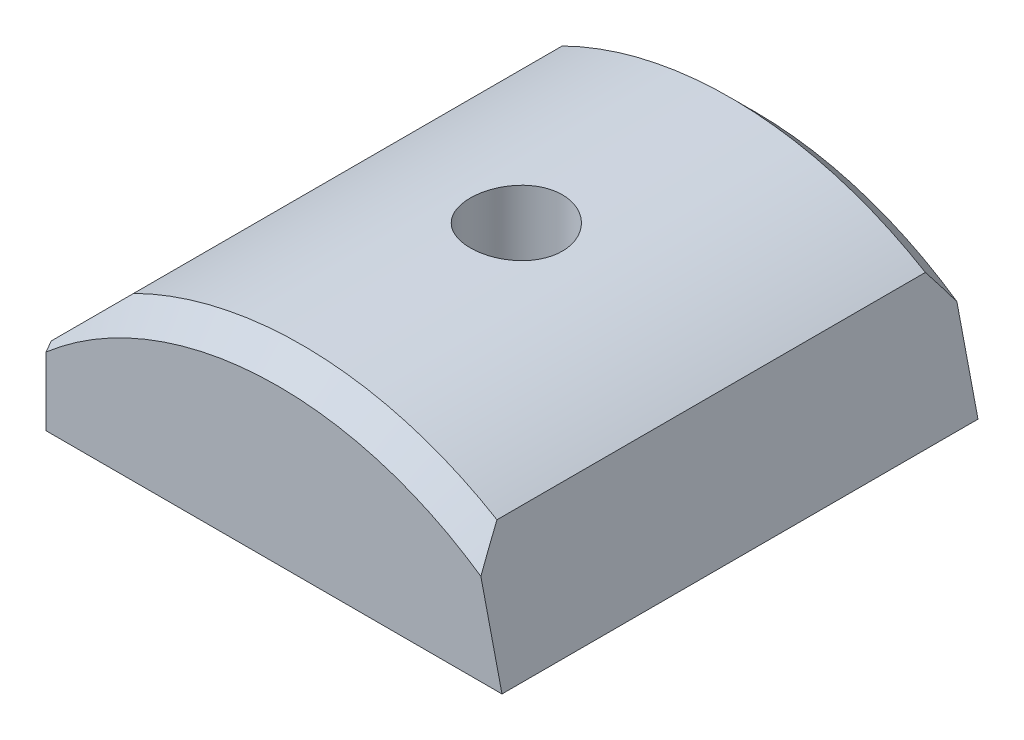
ISO-10303-21;
HEADER;
FILE_DESCRIPTION(('STEP AP214'),'2;1');
FILE_NAME('part.step','',(''),(''),'','','');
FILE_SCHEMA(('AUTOMOTIVE_DESIGN { 1 0 10303 214 1 1 1 1 }'));
ENDSEC;
DATA;
#1=APPLICATION_CONTEXT('core data for automotive mechanical design processes');
#2=APPLICATION_PROTOCOL_DEFINITION('international standard','automotive_design',2000,#1);
#3=PRODUCT_CONTEXT('',#1,'mechanical');
#4=PRODUCT('Part','Part','',(#3));
#5=PRODUCT_RELATED_PRODUCT_CATEGORY('part','',(#4));
#6=PRODUCT_DEFINITION_FORMATION('','',#4);
#7=PRODUCT_DEFINITION_CONTEXT('part definition',#1,'design');
#8=PRODUCT_DEFINITION('design','',#6,#7);
#9=PRODUCT_DEFINITION_SHAPE('','',#8);
#10=(LENGTH_UNIT() NAMED_UNIT(*) SI_UNIT(.MILLI.,.METRE.));
#11=(NAMED_UNIT(*) PLANE_ANGLE_UNIT() SI_UNIT($,.RADIAN.));
#12=(NAMED_UNIT(*) SI_UNIT($,.STERADIAN.) SOLID_ANGLE_UNIT());
#13=UNCERTAINTY_MEASURE_WITH_UNIT(LENGTH_MEASURE(1.E-05),#10,'distance_accuracy_value','');
#14=(GEOMETRIC_REPRESENTATION_CONTEXT(3) GLOBAL_UNCERTAINTY_ASSIGNED_CONTEXT((#13)) GLOBAL_UNIT_ASSIGNED_CONTEXT((#10,
#11,#12)) REPRESENTATION_CONTEXT('',''));
#15=CARTESIAN_POINT('',(0.,0.,0.));
#16=DIRECTION('',(0.,0.,1.));
#17=DIRECTION('',(1.,0.,0.));
#18=AXIS2_PLACEMENT_3D('',#15,#16,#17);
#19=CARTESIAN_POINT('',(317.649422074255,-18.1991000000002,-12.6999999999984));
#20=DIRECTION('',(0.,-1.,0.));
#21=DIRECTION('',(0.,0.,-0.999999999999981));
#22=AXIS2_PLACEMENT_3D('',#19,#20,#21);
#23=CYLINDRICAL_SURFACE('',#22,2.45744999999997);
#24=CARTESIAN_POINT('',(317.649422074253,-8.67410000000032,-15.1574499999998));
#25=CARTESIAN_POINT('',(317.511929904891,-8.67410187446606,-15.1574441402276));
#26=CARTESIAN_POINT('',(317.374351063043,-8.67551731773712,-15.1458722540717));
#27=CARTESIAN_POINT('',(317.103019591275,-8.68102765803355,-15.0998911914264));
#28=CARTESIAN_POINT('',(316.969271144695,-8.68512537611935,-15.0654579701706));
#29=CARTESIAN_POINT('',(316.70956798858,-8.69553849528051,-14.9747818703709));
#30=CARTESIAN_POINT('',(316.583608178072,-8.7018524264152,-14.918553445291));
#31=CARTESIAN_POINT('',(316.342937356986,-8.71599516569761,-14.7859141521873));
#32=CARTESIAN_POINT('',(316.228224375457,-8.72382370769968,-14.7095068291164));
#33=CARTESIAN_POINT('',(316.012680496114,-8.74016685487067,-14.5382522312213));
#34=CARTESIAN_POINT('',(315.911916715178,-8.7486844844394,-14.4433207621636));
#35=CARTESIAN_POINT('',(315.727709420239,-8.76542133883458,-14.237893272724));
#36=CARTESIAN_POINT('',(315.644266776097,-8.77364054865738,-14.1273964711229));
#37=CARTESIAN_POINT('',(315.496822045927,-8.78887985258722,-13.8935409257429));
#38=CARTESIAN_POINT('',(315.432882548102,-8.79589605518852,-13.7701424450001));
#39=CARTESIAN_POINT('',(315.32665880626,-8.80789534668128,-13.5142598881423));
#40=CARTESIAN_POINT('',(315.284373784824,-8.81287850855972,-13.3817761383916));
#41=CARTESIAN_POINT('',(315.222862594145,-8.82021880742301,-13.1121788259729));
#42=CARTESIAN_POINT('',(315.203523353513,-8.82258881727955,-12.9750914181811));
#43=CARTESIAN_POINT('',(315.188102866298,-8.82447393526225,-12.699597879681));
#44=CARTESIAN_POINT('',(315.192020733663,-8.82398915215052,-12.5611917994122));
#45=CARTESIAN_POINT('',(315.222910375376,-8.82023123726182,-12.2877764676831));
#46=CARTESIAN_POINT('',(315.249757763625,-8.81697315018539,-12.1527529273366));
#47=CARTESIAN_POINT('',(315.325550355815,-8.80805919979294,-11.8891419986247));
#48=CARTESIAN_POINT('',(315.374495985129,-8.80240329032099,-11.7605547342051));
#49=CARTESIAN_POINT('',(315.493229911542,-8.78931387276595,-11.5130790742763));
#50=CARTESIAN_POINT('',(315.563072432318,-8.78187575028561,-11.3942169482279));
#51=CARTESIAN_POINT('',(315.721578753802,-8.76606360764036,-11.1698534209687));
#52=CARTESIAN_POINT('',(315.810243368653,-8.7576895469992,-11.0643525980117));
#53=CARTESIAN_POINT('',(316.004567180339,-8.74088216472434,-10.8689843553321));
#54=CARTESIAN_POINT('',(316.11033362332,-8.7324488133593,-10.7792235765267));
#55=CARTESIAN_POINT('',(316.335489036009,-8.71652432937455,-10.6187131565693));
#56=CARTESIAN_POINT('',(316.454878034284,-8.7090331987308,-10.5479635552857));
#57=CARTESIAN_POINT('',(316.703970519451,-8.69583290990687,-10.4274843921948));
#58=CARTESIAN_POINT('',(316.833677174204,-8.69012430169015,-10.3777613160497));
#59=CARTESIAN_POINT('',(317.099683479932,-8.68113732791963,-10.3008303308425));
#60=CARTESIAN_POINT('',(317.235982838887,-8.67785885482889,-10.2736214254901));
#61=CARTESIAN_POINT('',(317.510383229401,-8.67411549772542,-10.2426289147071));
#62=CARTESIAN_POINT('',(317.648467433306,-8.67363296517091,-10.2386983680788));
#63=CARTESIAN_POINT('',(317.923326619121,-8.67548825632435,-10.2539866471248));
#64=CARTESIAN_POINT('',(318.060101627304,-8.67782602331489,-10.2732050072648));
#65=CARTESIAN_POINT('',(318.328027735488,-8.68504820302328,-10.3341235137671));
#66=CARTESIAN_POINT('',(318.459194954097,-8.68992469926325,-10.3757537871087));
#67=CARTESIAN_POINT('',(318.712685915293,-8.70167822043343,-10.480241871744));
#68=CARTESIAN_POINT('',(318.835009372433,-8.70855530990045,-10.5431003678461));
#69=CARTESIAN_POINT('',(319.067997976427,-8.72358693780734,-10.6886174337716));
#70=CARTESIAN_POINT('',(319.178603217687,-8.73174755583881,-10.7713712802603));
#71=CARTESIAN_POINT('',(319.3844066977,-8.74841382523692,-10.9541949053309));
#72=CARTESIAN_POINT('',(319.479604359131,-8.75691948951752,-11.054265332475));
#73=CARTESIAN_POINT('',(319.652410036199,-8.773371462372,-11.2695278471097));
#74=CARTESIAN_POINT('',(319.72992079114,-8.78131451986276,-11.3847982967913));
#75=CARTESIAN_POINT('',(319.864480995048,-8.79568902617447,-11.6268075582974));
#76=CARTESIAN_POINT('',(319.921530835205,-8.80212050389436,-11.7535461508056));
#77=CARTESIAN_POINT('',(320.013391497687,-8.81272175125461,-12.0145772601035));
#78=CARTESIAN_POINT('',(320.048257613125,-8.81689714026251,-12.1488500805239));
#79=CARTESIAN_POINT('',(320.094939382803,-8.82252975673961,-12.4213984507332));
#80=CARTESIAN_POINT('',(320.106756046314,-8.82398710322417,-12.5596738249924));
#81=CARTESIAN_POINT('',(320.106985649578,-8.82401529656608,-12.8353347200178));
#82=CARTESIAN_POINT('',(320.095551383374,-8.82260498828833,-12.9727201367028));
#83=CARTESIAN_POINT('',(320.049926780133,-8.8170972422816,-13.2436013285751));
#84=CARTESIAN_POINT('',(320.015736436633,-8.81299980378959,-13.3770971026579));
#85=CARTESIAN_POINT('',(319.925617171257,-8.80258521205339,-13.6363922622622));
#86=CARTESIAN_POINT('',(319.869695185616,-8.79626876712633,-13.7621940887003));
#87=CARTESIAN_POINT('',(319.737715138037,-8.78212665374967,-14.0026525288262));
#88=CARTESIAN_POINT('',(319.661656878294,-8.77430097047462,-14.1173090330155));
#89=CARTESIAN_POINT('',(319.490995169939,-8.75796050227237,-14.3330036451214));
#90=CARTESIAN_POINT('',(319.396277803922,-8.74944168319947,-14.4339513195139));
#91=CARTESIAN_POINT('',(319.191223070371,-8.7327106361517,-14.6185791663093));
#92=CARTESIAN_POINT('',(319.080882017274,-8.72449848109687,-14.7022552529377));
#93=CARTESIAN_POINT('',(318.847258582611,-8.70927360063646,-14.8502190063999));
#94=CARTESIAN_POINT('',(318.723931017156,-8.70226530221064,-14.9144357491268));
#95=CARTESIAN_POINT('',(318.468227789181,-8.690283001983,-15.0211570107939));
#96=CARTESIAN_POINT('',(318.335862194891,-8.68530677827961,-15.063685257003));
#97=CARTESIAN_POINT('',(318.110571743618,-8.67915660996209,-15.1155777956583));
#98=CARTESIAN_POINT('',(318.0190707328,-8.67726955897917,-15.1312574756522));
#99=CARTESIAN_POINT('',(317.834866978867,-8.67474062606404,-15.152195518502));
#100=CARTESIAN_POINT('',(317.742164243968,-8.67409873562272,-15.1574539525739));
#101=CARTESIAN_POINT('',(317.649422074253,-8.67410000000032,-15.1574499999998));
#102=B_SPLINE_CURVE_WITH_KNOTS('',3,(#24,#25,#26,#27,#28,#29,#30,#31,#32,#33,#34,#35,#36,#37,
#38,#39,#40,#41,#42,#43,#44,#45,#46,#47,#48,#49,#50,#51,#52,#53,#54,#55,#56,#57,#58,#59,#60,#61,
#62,#63,#64,#65,#66,#67,#68,#69,#70,#71,#72,#73,#74,#75,#76,#77,#78,#79,#80,#81,#82,#83,#84,#85,
#86,#87,#88,#89,#90,#91,#92,#93,#94,#95,#96,#97,#98,#99,#100,#101),.UNSPECIFIED.,.T.,.F.,(4,2,2,
2,2,2,2,2,2,2,2,2,2,2,2,2,2,2,2,2,2,2,2,2,2,2,2,2,2,2,2,2,2,2,2,2,2,2,4),(0.,0.412137765395902,
0.824709691266764,1.23700848733512,1.6492349004296,2.06338050488344,2.47754690258661,
2.89302876136736,3.3084957028722,3.72190670404872,4.1353019551646,4.54646879614702,
4.9576435520814,5.36989462456952,5.78216353246954,6.19712591696391,6.61208917166991,
7.02718032919656,7.44225311725479,7.85470300331247,8.26714459496571,8.67830771266706,
9.08948409548337,9.50267021746702,9.91587181796546,10.3312936229164,10.7467074850367,
11.161081826095,11.5754380224529,11.987080067788,12.3987222300114,12.8102331133627,
13.2217480392467,13.6358578834239,14.0500655776244,14.4657652763556,14.8810092177135,
15.1590091355795,15.4370071536599),.UNSPECIFIED.);
#103=CARTESIAN_POINT('',(317.649422074253,-8.67410000000032,-15.1574499999998));
#104=VERTEX_POINT('',#103);
#105=EDGE_CURVE('E11',#104,#104,#102,.T.);
#106=ORIENTED_EDGE('',*,*,#105,.T.);
#107=EDGE_LOOP('',(#106));
#108=FACE_BOUND('',#107,.T.);
#109=CARTESIAN_POINT('',(317.649422074255,-15.0241000000003,-12.6999999999984));
#110=DIRECTION('',(0.,-1.,0.));
#111=DIRECTION('',(0.,0.,-0.999999999999981));
#112=AXIS2_PLACEMENT_3D('',#109,#110,#111);
#113=CIRCLE('',#112,2.45744999999997);
#114=CARTESIAN_POINT('',(317.649422074255,-15.0241000000003,-15.1574499999983));
#115=VERTEX_POINT('',#114);
#116=EDGE_CURVE('E39',#115,#115,#113,.F.);
#117=ORIENTED_EDGE('',*,*,#116,.F.);
#118=EDGE_LOOP('',(#117));
#119=FACE_BOUND('',#118,.T.);
#120=ADVANCED_FACE('F34',(#108,#119),#23,.F.);
#121=CARTESIAN_POINT('',(317.64942207426,-28.8925000000004,-25.4000000000012));
#122=DIRECTION('',(0.,0.,0.999999999999981));
#123=DIRECTION('',(0.999999999999993,0.,0.));
#124=AXIS2_PLACEMENT_3D('',#121,#122,#123);
#125=CYLINDRICAL_SURFACE('',#124,20.2184);
#126=ORIENTED_EDGE('',*,*,#105,.F.);
#127=EDGE_LOOP('',(#126));
#128=FACE_BOUND('',#127,.T.);
#129=DIRECTION('',(0.,0.,0.999999999999981));
#130=VECTOR('',#129,1.);
#131=CARTESIAN_POINT('',(308.661533038126,-10.7816869527023,-25.4000000000001));
#132=LINE('',#131,#130);
#133=CARTESIAN_POINT('',(308.661533038128,-10.7816869527023,-24.1300000000002));
#134=VERTEX_POINT('',#133);
#135=CARTESIAN_POINT('',(308.661533038126,-10.7816869527022,-1.26999999999899));
#136=VERTEX_POINT('',#135);
#137=EDGE_CURVE('E307',#134,#136,#132,.T.);
#138=ORIENTED_EDGE('',*,*,#137,.T.);
#139=CARTESIAN_POINT('',(317.649422074261,-28.8925000000004,-1.26999999999744));
#140=DIRECTION('',(0.,0.,0.999999999999981));
#141=DIRECTION('',(0.999999999999993,0.,0.));
#142=AXIS2_PLACEMENT_3D('',#139,#140,#141);
#143=CIRCLE('',#142,20.2184);
#144=CARTESIAN_POINT('',(328.045962535369,-11.551922010773,-1.2700000000001));
#145=VERTEX_POINT('',#144);
#146=EDGE_CURVE('E303',#136,#145,#143,.F.);
#147=ORIENTED_EDGE('',*,*,#146,.T.);
#148=DIRECTION('',(0.,0.,0.999999999999981));
#149=VECTOR('',#148,1.);
#150=CARTESIAN_POINT('',(328.045962535369,-11.5519220107724,-25.4000000000008));
#151=LINE('',#150,#149);
#152=CARTESIAN_POINT('',(328.04596253537,-11.5519220107719,-24.1299999999973));
#153=VERTEX_POINT('',#152);
#154=EDGE_CURVE('E234',#145,#153,#151,.F.);
#155=ORIENTED_EDGE('',*,*,#154,.T.);
#156=CARTESIAN_POINT('',(317.649422074262,-28.8925000000001,-24.1300000000004));
#157=DIRECTION('',(0.,0.,0.999999999999981));
#158=DIRECTION('',(0.999999999999993,0.,0.));
#159=AXIS2_PLACEMENT_3D('',#156,#157,#158);
#160=CIRCLE('',#159,20.2184);
#161=EDGE_CURVE('E318',#153,#134,#160,.T.);
#162=ORIENTED_EDGE('',*,*,#161,.T.);
#163=EDGE_LOOP('',(#138,#147,#155,#162));
#164=FACE_BOUND('',#163,.T.);
#165=ADVANCED_FACE('F277',(#128,#164),#125,.T.);
#166=CARTESIAN_POINT('',(300.490316765412,-18.1991000000014,-25.4000000000014));
#167=DIRECTION('',(0.,-1.,0.));
#168=DIRECTION('',(0.,0.,-0.999999999999981));
#169=AXIS2_PLACEMENT_3D('',#166,#167,#168);
#170=PLANE('',#169);
#171=DIRECTION('',(-0.999999999999993,0.,0.));
#172=VECTOR('',#171,1.);
#173=CARTESIAN_POINT('',(320.28906750499,-18.1991000000003,-8.12799999999769));
#174=LINE('',#173,#172);
#175=CARTESIAN_POINT('',(320.28906750499,-18.1991000000003,-8.12799999999769));
#176=VERTEX_POINT('',#175);
#177=CARTESIAN_POINT('',(315.00977664352,-18.1991000000002,-8.12799999999947));
#178=VERTEX_POINT('',#177);
#179=EDGE_CURVE('E51',#176,#178,#174,.T.);
#180=ORIENTED_EDGE('',*,*,#179,.F.);
#181=DIRECTION('',(-0.49999999999998,0.,0.866025403784417));
#182=VECTOR('',#181,1.);
#183=CARTESIAN_POINT('',(322.928712935725,-18.1990999999994,-12.6999999999986));
#184=LINE('',#183,#182);
#185=CARTESIAN_POINT('',(322.928712935725,-18.1990999999994,-12.6999999999986));
#186=VERTEX_POINT('',#185);
#187=EDGE_CURVE('E154',#186,#176,#184,.T.);
#188=ORIENTED_EDGE('',*,*,#187,.F.);
#189=DIRECTION('',(0.500000000000003,0.,0.866025403784431));
#190=VECTOR('',#189,1.);
#191=CARTESIAN_POINT('',(320.28906750499,-18.1990999999996,-17.2719999999973));
#192=LINE('',#191,#190);
#193=CARTESIAN_POINT('',(320.28906750499,-18.1990999999996,-17.2719999999973));
#194=VERTEX_POINT('',#193);
#195=EDGE_CURVE('E157',#194,#186,#192,.T.);
#196=ORIENTED_EDGE('',*,*,#195,.F.);
#197=DIRECTION('',(0.999999999999993,0.,0.));
#198=VECTOR('',#197,1.);
#199=CARTESIAN_POINT('',(315.00977664352,-18.1991000000002,-17.2720000000008));
#200=LINE('',#199,#198);
#201=CARTESIAN_POINT('',(315.00977664352,-18.1991000000002,-17.2720000000008));
#202=VERTEX_POINT('',#201);
#203=EDGE_CURVE('E173',#202,#194,#200,.T.);
#204=ORIENTED_EDGE('',*,*,#203,.F.);
#205=DIRECTION('',(0.49999999999999,0.,-0.86602540378441));
#206=VECTOR('',#205,1.);
#207=CARTESIAN_POINT('',(312.370131212785,-18.1991000000009,-12.6999999999968));
#208=LINE('',#207,#206);
#209=CARTESIAN_POINT('',(312.370131212785,-18.1991000000009,-12.6999999999968));
#210=VERTEX_POINT('',#209);
#211=EDGE_CURVE('E170',#210,#202,#208,.T.);
#212=ORIENTED_EDGE('',*,*,#211,.F.);
#213=DIRECTION('',(-0.500000000000011,0.,-0.866025403784427));
#214=VECTOR('',#213,1.);
#215=CARTESIAN_POINT('',(315.00977664352,-18.1991000000002,-8.12799999999947));
#216=LINE('',#215,#214);
#217=EDGE_CURVE('E168',#178,#210,#216,.T.);
#218=ORIENTED_EDGE('',*,*,#217,.F.);
#219=EDGE_LOOP('',(#180,#188,#196,#204,#212,#218));
#220=FACE_BOUND('',#219,.T.);
#221=DIRECTION('',(0.999999999999993,0.,0.));
#222=VECTOR('',#221,1.);
#223=CARTESIAN_POINT('',(300.490316765412,-18.1991000000014,-25.4000000000014));
#224=LINE('',#223,#222);
#225=CARTESIAN_POINT('',(305.252816765415,-18.1990999999997,-25.4000000000001));
#226=VERTEX_POINT('',#225);
#227=CARTESIAN_POINT('',(329.584319628552,-18.1990999999999,-25.3999999999979));
#228=VERTEX_POINT('',#227);
#229=EDGE_CURVE('E196',#226,#228,#224,.T.);
#230=ORIENTED_EDGE('',*,*,#229,.T.);
#231=DIRECTION('',(0.,0.,-0.999999999999981));
#232=VECTOR('',#231,1.);
#233=CARTESIAN_POINT('',(329.584319628552,-18.1990999999999,-25.3999999999979));
#234=LINE('',#233,#232);
#235=CARTESIAN_POINT('',(329.584319628551,-18.1991000000005,2.22044604925031E-13));
#236=VERTEX_POINT('',#235);
#237=EDGE_CURVE('E44',#228,#236,#234,.F.);
#238=ORIENTED_EDGE('',*,*,#237,.T.);
#239=DIRECTION('',(0.999999999999993,0.,0.));
#240=VECTOR('',#239,1.);
#241=CARTESIAN_POINT('',(300.49031676541,-18.1991000000016,1.77635683940025E-12));
#242=LINE('',#241,#240);
#243=CARTESIAN_POINT('',(305.252816765416,-18.1991000000006,4.44089209850063E-13));
#244=VERTEX_POINT('',#243);
#245=EDGE_CURVE('E195',#244,#236,#242,.T.);
#246=ORIENTED_EDGE('',*,*,#245,.F.);
#247=DIRECTION('',(0.,0.,0.999999999999981));
#248=VECTOR('',#247,1.);
#249=CARTESIAN_POINT('',(305.252816765415,-18.1990999999997,-25.4000000000001));
#250=LINE('',#249,#248);
#251=EDGE_CURVE('E189',#226,#244,#250,.T.);
#252=ORIENTED_EDGE('',*,*,#251,.F.);
#253=EDGE_LOOP('',(#230,#238,#246,#252));
#254=FACE_BOUND('',#253,.T.);
#255=ADVANCED_FACE('F281',(#220,#254),#170,.T.);
#256=CARTESIAN_POINT('',(317.64942207426,-28.8925000000004,-25.4000000000012));
#257=DIRECTION('',(0.,0.,0.999999999999981));
#258=DIRECTION('',(0.999999999999993,0.,0.));
#259=AXIS2_PLACEMENT_3D('',#256,#257,#258);
#260=PLANE('',#259);
#261=DIRECTION('',(0.,1.,0.));
#262=VECTOR('',#261,1.);
#263=CARTESIAN_POINT('',(305.252816765415,-18.1990999999997,-25.4000000000001));
#264=LINE('',#263,#262);
#265=CARTESIAN_POINT('',(305.252816765416,-14.5619019881662,-25.4000000000005));
#266=VERTEX_POINT('',#265);
#267=EDGE_CURVE('E187',#226,#266,#264,.T.);
#268=ORIENTED_EDGE('',*,*,#267,.T.);
#269=CARTESIAN_POINT('',(317.64942207426,-28.8925000000004,-25.4000000000012));
#270=DIRECTION('',(0.,0.,0.999999999999981));
#271=DIRECTION('',(0.999999999999993,0.,0.));
#272=AXIS2_PLACEMENT_3D('',#269,#270,#271);
#273=CIRCLE('',#272,18.9484);
#274=CARTESIAN_POINT('',(328.457138177124,-13.3285951172336,-25.3999999999983));
#275=VERTEX_POINT('',#274);
#276=EDGE_CURVE('E59',#266,#275,#273,.F.);
#277=ORIENTED_EDGE('',*,*,#276,.T.);
#278=DIRECTION('',(-0.225470763624212,0.974249934437109,0.));
#279=VECTOR('',#278,1.);
#280=CARTESIAN_POINT('',(330.046027383102,-20.1941202960417,-25.4000000000008));
#281=LINE('',#280,#279);
#282=EDGE_CURVE('E313',#275,#228,#281,.F.);
#283=ORIENTED_EDGE('',*,*,#282,.T.);
#284=ORIENTED_EDGE('',*,*,#229,.F.);
#285=EDGE_LOOP('',(#268,#277,#283,#284));
#286=FACE_BOUND('',#285,.T.);
#287=ADVANCED_FACE('F224',(#286),#260,.F.);
#288=CARTESIAN_POINT('',(317.649422074258,-28.8925000000003,6.66133814775094E-13));
#289=DIRECTION('',(0.,0.,0.999999999999981));
#290=DIRECTION('',(0.999999999999993,0.,0.));
#291=AXIS2_PLACEMENT_3D('',#288,#289,#290);
#292=PLANE('',#291);
#293=DIRECTION('',(0.225470763624212,-0.974249934437109,0.));
#294=VECTOR('',#293,1.);
#295=CARTESIAN_POINT('',(331.326548855117,-25.72720112703,1.11022302462516E-12));
#296=LINE('',#295,#294);
#297=CARTESIAN_POINT('',(328.457138177127,-13.3285951172342,0.));
#298=VERTEX_POINT('',#297);
#299=EDGE_CURVE('E199',#236,#298,#296,.F.);
#300=ORIENTED_EDGE('',*,*,#299,.T.);
#301=CARTESIAN_POINT('',(317.649422074258,-28.8925000000003,6.66133814775094E-13));
#302=DIRECTION('',(0.,0.,0.999999999999981));
#303=DIRECTION('',(0.999999999999993,0.,0.));
#304=AXIS2_PLACEMENT_3D('',#301,#302,#303);
#305=CIRCLE('',#304,18.9484);
#306=CARTESIAN_POINT('',(305.252816765417,-14.5619019881667,0.));
#307=VERTEX_POINT('',#306);
#308=EDGE_CURVE('E203',#298,#307,#305,.T.);
#309=ORIENTED_EDGE('',*,*,#308,.T.);
#310=DIRECTION('',(0.,1.,0.));
#311=VECTOR('',#310,1.);
#312=CARTESIAN_POINT('',(305.252816765416,-18.1990999999996,4.44089209850063E-13));
#313=LINE('',#312,#311);
#314=EDGE_CURVE('E190',#244,#307,#313,.T.);
#315=ORIENTED_EDGE('',*,*,#314,.F.);
#316=ORIENTED_EDGE('',*,*,#245,.T.);
#317=EDGE_LOOP('',(#300,#309,#315,#316));
#318=FACE_BOUND('',#317,.T.);
#319=ADVANCED_FACE('F220',(#318),#292,.T.);
#320=CARTESIAN_POINT('',(305.252816765415,-18.1990999999997,-25.4000000000001));
#321=DIRECTION('',(0.999999999999993,0.,0.));
#322=DIRECTION('',(0.,0.,-0.999999999999981));
#323=AXIS2_PLACEMENT_3D('',#320,#321,#322);
#324=PLANE('',#323);
#325=ORIENTED_EDGE('',*,*,#314,.T.);
#326=CARTESIAN_POINT('',(305.252816765417,-14.5619019881667,0.));
#327=CARTESIAN_POINT('',(305.252816765416,-14.4998631019893,-0.0469221573685567));
#328=CARTESIAN_POINT('',(305.252816765415,-14.4378854282847,-0.0939248118909561));
#329=CARTESIAN_POINT('',(305.252816765415,-14.31405250737,-0.188091114065723));
#330=CARTESIAN_POINT('',(305.252816765415,-14.2521972601569,-0.235254761714063));
#331=CARTESIAN_POINT('',(305.252816765416,-14.1904032254136,-0.282498906512219));
#332=B_SPLINE_CURVE_WITH_KNOTS('',3,(#326,#327,#328,#329,#330,#331),.UNSPECIFIED.,.F.,.F.,(4,2,
4),(0.,0.233354524554041,0.466709043271053),.UNSPECIFIED.);
#333=CARTESIAN_POINT('',(305.252816765416,-14.1904032254136,-0.282498906512219));
#334=VERTEX_POINT('',#333);
#335=EDGE_CURVE('E227',#307,#334,#332,.T.);
#336=ORIENTED_EDGE('',*,*,#335,.T.);
#337=DIRECTION('',(0.,0.,-0.999999999999981));
#338=VECTOR('',#337,1.);
#339=CARTESIAN_POINT('',(305.252816765416,-14.190403225413,-25.4000000000005));
#340=LINE('',#339,#338);
#341=CARTESIAN_POINT('',(305.252816765416,-14.190403225413,-25.1175010934841));
#342=VERTEX_POINT('',#341);
#343=EDGE_CURVE('E213',#334,#342,#340,.T.);
#344=ORIENTED_EDGE('',*,*,#343,.T.);
#345=CARTESIAN_POINT('',(305.252816765416,-14.190403225413,-25.1175010934841));
#346=CARTESIAN_POINT('',(305.252816765415,-14.2521972601568,-25.1647452382823));
#347=CARTESIAN_POINT('',(305.252816765415,-14.3140525073702,-25.211908885931));
#348=CARTESIAN_POINT('',(305.252816765415,-14.4378854282849,-25.3060751881072));
#349=CARTESIAN_POINT('',(305.252816765416,-14.4998631019892,-25.3530778426306));
#350=CARTESIAN_POINT('',(305.252816765416,-14.5619019881662,-25.4000000000005));
#351=B_SPLINE_CURVE_WITH_KNOTS('',3,(#345,#346,#347,#348,#349,#350),.UNSPECIFIED.,.F.,.F.,(4,2,
4),(0.,0.233354518718332,0.466709043273691),.UNSPECIFIED.);
#352=EDGE_CURVE('E206',#342,#266,#351,.T.);
#353=ORIENTED_EDGE('',*,*,#352,.T.);
#354=ORIENTED_EDGE('',*,*,#267,.F.);
#355=ORIENTED_EDGE('',*,*,#251,.T.);
#356=EDGE_LOOP('',(#325,#336,#344,#353,#354,#355));
#357=FACE_BOUND('',#356,.T.);
#358=ADVANCED_FACE('F215',(#357),#324,.F.);
#359=CARTESIAN_POINT('',(317.649422074262,-28.8925000000001,-24.1300000000004));
#360=DIRECTION('',(0.,0.,0.999999999999981));
#361=DIRECTION('',(0.999999999999993,0.,0.));
#362=AXIS2_PLACEMENT_3D('',#359,#360,#361);
#363=CONICAL_SURFACE('',#362,20.2184,0.785398163397448);
#364=CARTESIAN_POINT('',(305.252816765416,-14.190403225413,-25.1175010934841));
#365=CARTESIAN_POINT('',(305.397848858909,-14.0453711319192,-25.1001188708145));
#366=CARTESIAN_POINT('',(305.54267487549,-13.9005451153384,-25.0794932083466));
#367=CARTESIAN_POINT('',(305.831797804002,-13.6114221868265,-25.0319201937804));
#368=CARTESIAN_POINT('',(305.976094749779,-13.4671252410495,-25.0049732534964));
#369=CARTESIAN_POINT('',(306.407109683688,-13.0361103071407,-24.915089249765));
#370=CARTESIAN_POINT('',(306.692895101616,-12.7503248892126,-24.8429938519173));
#371=CARTESIAN_POINT('',(307.261001607807,-12.1822183830208,-24.6761250754606));
#372=CARTESIAN_POINT('',(307.543323624338,-11.8998963664899,-24.5813579194408));
#373=CARTESIAN_POINT('',(308.105006970556,-11.3382130202723,-24.3708785497586));
#374=CARTESIAN_POINT('',(308.38435607054,-11.0588639202892,-24.255100861308));
#375=CARTESIAN_POINT('',(308.661533038128,-10.7816869527023,-24.1300000000002));
#376=B_SPLINE_CURVE_WITH_KNOTS('',3,(#364,#365,#366,#367,#368,#369,#370,#371,#372,#373,#374,
#375),.UNSPECIFIED.,.F.,.F.,(4,2,2,2,2,4),(0.,0.617468668335929,1.23489712141749,
2.46574371111204,3.69625286409233,4.93066462191591),.UNSPECIFIED.);
#377=EDGE_CURVE('E262',#134,#342,#376,.F.);
#378=ORIENTED_EDGE('',*,*,#377,.F.);
#379=ORIENTED_EDGE('',*,*,#161,.F.);
#380=CARTESIAN_POINT('',(328.457138177124,-13.3285951172336,-25.3999999999983));
#381=CARTESIAN_POINT('',(328.422472883651,-13.1788078039972,-25.2967376574103));
#382=CARTESIAN_POINT('',(328.387914594732,-13.0294828530677,-25.1927704415529));
#383=CARTESIAN_POINT('',(328.319003450212,-12.731720620163,-24.9835262916234));
#384=CARTESIAN_POINT('',(328.284650581356,-12.5832832809128,-24.8782494434385));
#385=CARTESIAN_POINT('',(328.216137398983,-12.2872406261532,-24.6664732333886));
#386=CARTESIAN_POINT('',(328.181977084244,-12.1396353053538,-24.5599738793095));
#387=CARTESIAN_POINT('',(328.113836609836,-11.8452031064415,-24.3458264665761));
#388=CARTESIAN_POINT('',(328.079856462065,-11.6983762797383,-24.2381783334393));
#389=CARTESIAN_POINT('',(328.045962535369,-11.5519220107719,-24.1300000000015));
#390=B_SPLINE_CURVE_WITH_KNOTS('',3,(#380,#381,#382,#383,#384,#385,#386,#387,#388,#389),
.UNSPECIFIED.,.F.,.F.,(4,2,2,2,4),(0.,0.555612806350865,1.11118936505767,1.66676238737087,
2.22237165250193),.UNSPECIFIED.);
#391=EDGE_CURVE('E193',#275,#153,#390,.T.);
#392=ORIENTED_EDGE('',*,*,#391,.F.);
#393=ORIENTED_EDGE('',*,*,#276,.F.);
#394=ORIENTED_EDGE('',*,*,#352,.F.);
#395=EDGE_LOOP('',(#378,#379,#392,#393,#394));
#396=FACE_BOUND('',#395,.T.);
#397=ADVANCED_FACE('F36',(#396),#363,.T.);
#398=CARTESIAN_POINT('',(330.046027383102,-20.1941202960417,-25.4000000000008));
#399=DIRECTION('',(-0.974249934437103,-0.225470763624225,0.));
#400=DIRECTION('',(0.,0.,0.999999999999981));
#401=AXIS2_PLACEMENT_3D('',#398,#399,#400);
#402=PLANE('',#401);
#403=ORIENTED_EDGE('',*,*,#391,.T.);
#404=ORIENTED_EDGE('',*,*,#154,.F.);
#405=CARTESIAN_POINT('',(328.045962535369,-11.551922010773,-1.2700000000001));
#406=CARTESIAN_POINT('',(328.079856462065,-11.6983762797394,-1.16182166656202));
#407=CARTESIAN_POINT('',(328.113836609836,-11.8452031064426,-1.05417353342497));
#408=CARTESIAN_POINT('',(328.181977084244,-12.1396353053551,-0.840026120691284));
#409=CARTESIAN_POINT('',(328.216137398984,-12.2872406261546,-0.733526766612111));
#410=CARTESIAN_POINT('',(328.284650581356,-12.5832832809146,-0.521750556562183));
#411=CARTESIAN_POINT('',(328.319003450212,-12.7317206201651,-0.41647370837732));
#412=CARTESIAN_POINT('',(328.387914594733,-13.0294828530697,-0.207229558447231));
#413=CARTESIAN_POINT('',(328.422472883652,-13.1788078039988,-0.103262342589257));
#414=CARTESIAN_POINT('',(328.457138177127,-13.3285951172342,0.));
#415=B_SPLINE_CURVE_WITH_KNOTS('',3,(#405,#406,#407,#408,#409,#410,#411,#412,#413,#414),
.UNSPECIFIED.,.F.,.F.,(4,2,2,2,4),(0.,0.555609265131548,1.11118228744524,1.66675884615253,
2.22237165250386),.UNSPECIFIED.);
#416=EDGE_CURVE('E256',#298,#145,#415,.F.);
#417=ORIENTED_EDGE('',*,*,#416,.F.);
#418=ORIENTED_EDGE('',*,*,#299,.F.);
#419=ORIENTED_EDGE('',*,*,#237,.F.);
#420=ORIENTED_EDGE('',*,*,#282,.F.);
#421=EDGE_LOOP('',(#403,#404,#417,#418,#419,#420));
#422=FACE_BOUND('',#421,.T.);
#423=ADVANCED_FACE('F244',(#422),#402,.F.);
#424=CARTESIAN_POINT('',(308.661533038126,-10.7816869527023,-25.4000000000001));
#425=DIRECTION('',(0.707106781186539,-0.707106781186541,0.));
#426=DIRECTION('',(0.,0.,0.999999999999981));
#427=AXIS2_PLACEMENT_3D('',#424,#425,#426);
#428=PLANE('',#427);
#429=ORIENTED_EDGE('',*,*,#377,.T.);
#430=ORIENTED_EDGE('',*,*,#343,.F.);
#431=CARTESIAN_POINT('',(305.252816765416,-14.1904032254136,-0.282498906512219));
#432=CARTESIAN_POINT('',(305.397848858909,-14.0453711319195,-0.299881129182547));
#433=CARTESIAN_POINT('',(305.542674875489,-13.9005451153386,-0.320506791650809));
#434=CARTESIAN_POINT('',(305.831797804001,-13.6114221868266,-0.368079806217237));
#435=CARTESIAN_POINT('',(305.976094749778,-13.4671252410496,-0.395026746501182));
#436=CARTESIAN_POINT('',(306.407109683687,-13.0361103071408,-0.484910750232616));
#437=CARTESIAN_POINT('',(306.692895101615,-12.7503248892127,-0.557006148080409));
#438=CARTESIAN_POINT('',(307.261001607807,-12.1822183830209,-0.72387492453718));
#439=CARTESIAN_POINT('',(307.543323624338,-11.8998963664899,-0.818642080556928));
#440=CARTESIAN_POINT('',(308.105006970555,-11.3382130202723,-1.02912145023943));
#441=CARTESIAN_POINT('',(308.384356070539,-11.0588639202892,-1.14489913869043));
#442=CARTESIAN_POINT('',(308.661533038126,-10.7816869527022,-1.26999999999899));
#443=B_SPLINE_CURVE_WITH_KNOTS('',3,(#431,#432,#433,#434,#435,#436,#437,#438,#439,#440,#441,
#442),.UNSPECIFIED.,.F.,.F.,(4,2,2,2,2,4),(0.,0.617468668335933,1.23489712141751,
2.46574371111208,3.69625286409259,4.93066462191629),.UNSPECIFIED.);
#444=EDGE_CURVE('E249',#136,#334,#443,.F.);
#445=ORIENTED_EDGE('',*,*,#444,.F.);
#446=ORIENTED_EDGE('',*,*,#137,.F.);
#447=EDGE_LOOP('',(#429,#430,#445,#446));
#448=FACE_BOUND('',#447,.T.);
#449=ADVANCED_FACE('F240',(#448),#428,.F.);
#450=CARTESIAN_POINT('',(317.649422074258,-28.8925000000003,6.66133814775094E-13));
#451=DIRECTION('',(0.,0.,-0.999999999999981));
#452=DIRECTION('',(-0.999999999999993,0.,0.));
#453=AXIS2_PLACEMENT_3D('',#450,#451,#452);
#454=CONICAL_SURFACE('',#453,18.9484,0.785398163397446);
#455=ORIENTED_EDGE('',*,*,#416,.T.);
#456=ORIENTED_EDGE('',*,*,#146,.F.);
#457=ORIENTED_EDGE('',*,*,#444,.T.);
#458=ORIENTED_EDGE('',*,*,#335,.F.);
#459=ORIENTED_EDGE('',*,*,#308,.F.);
#460=EDGE_LOOP('',(#455,#456,#457,#458,#459));
#461=FACE_BOUND('',#460,.T.);
#462=ADVANCED_FACE('F236',(#461),#454,.T.);
#463=CARTESIAN_POINT('',(1.88737914186277E-12,-15.0241000000032,4.44089209850063E-13));
#464=DIRECTION('',(0.,-1.,0.));
#465=DIRECTION('',(0.,0.,-0.999999999999981));
#466=AXIS2_PLACEMENT_3D('',#463,#464,#465);
#467=PLANE('',#466);
#468=DIRECTION('',(-0.999999999999993,0.,0.));
#469=VECTOR('',#468,1.);
#470=CARTESIAN_POINT('',(320.28906750499,-15.0241000000003,-8.12799999999925));
#471=LINE('',#470,#469);
#472=CARTESIAN_POINT('',(320.28906750499,-15.0241000000003,-8.12799999999925));
#473=VERTEX_POINT('',#472);
#474=CARTESIAN_POINT('',(315.009776643519,-15.0241000000003,-8.12800000000169));
#475=VERTEX_POINT('',#474);
#476=EDGE_CURVE('E134',#473,#475,#471,.T.);
#477=ORIENTED_EDGE('',*,*,#476,.T.);
#478=DIRECTION('',(-0.500000000000011,0.,-0.866025403784427));
#479=VECTOR('',#478,1.);
#480=CARTESIAN_POINT('',(315.009776643519,-15.0241000000003,-8.12800000000169));
#481=LINE('',#480,#479);
#482=CARTESIAN_POINT('',(312.370131212785,-15.0241000000009,-12.6999999999982));
#483=VERTEX_POINT('',#482);
#484=EDGE_CURVE('E143',#475,#483,#481,.T.);
#485=ORIENTED_EDGE('',*,*,#484,.T.);
#486=DIRECTION('',(0.49999999999999,0.,-0.86602540378441));
#487=VECTOR('',#486,1.);
#488=CARTESIAN_POINT('',(312.370131212785,-15.0241000000009,-12.6999999999982));
#489=LINE('',#488,#487);
#490=CARTESIAN_POINT('',(315.00977664352,-15.0241000000004,-17.2720000000008));
#491=VERTEX_POINT('',#490);
#492=EDGE_CURVE('E148',#483,#491,#489,.T.);
#493=ORIENTED_EDGE('',*,*,#492,.T.);
#494=DIRECTION('',(0.999999999999993,0.,0.));
#495=VECTOR('',#494,1.);
#496=CARTESIAN_POINT('',(315.00977664352,-15.0241000000004,-17.2720000000008));
#497=LINE('',#496,#495);
#498=CARTESIAN_POINT('',(320.289067504991,-15.0240999999997,-17.272));
#499=VERTEX_POINT('',#498);
#500=EDGE_CURVE('E161',#491,#499,#497,.T.);
#501=ORIENTED_EDGE('',*,*,#500,.T.);
#502=DIRECTION('',(0.500000000000003,0.,0.866025403784431));
#503=VECTOR('',#502,1.);
#504=CARTESIAN_POINT('',(320.289067504991,-15.0240999999997,-17.272));
#505=LINE('',#504,#503);
#506=CARTESIAN_POINT('',(322.928712935725,-15.0240999999994,-12.6999999999986));
#507=VERTEX_POINT('',#506);
#508=EDGE_CURVE('E164',#499,#507,#505,.T.);
#509=ORIENTED_EDGE('',*,*,#508,.T.);
#510=DIRECTION('',(-0.49999999999998,0.,0.866025403784417));
#511=VECTOR('',#510,1.);
#512=CARTESIAN_POINT('',(322.928712935725,-15.0240999999994,-12.6999999999986));
#513=LINE('',#512,#511);
#514=EDGE_CURVE('E140',#507,#473,#513,.T.);
#515=ORIENTED_EDGE('',*,*,#514,.T.);
#516=EDGE_LOOP('',(#477,#485,#493,#501,#509,#515));
#517=FACE_BOUND('',#516,.T.);
#518=ORIENTED_EDGE('',*,*,#116,.T.);
#519=EDGE_LOOP('',(#518));
#520=FACE_BOUND('',#519,.T.);
#521=ADVANCED_FACE('F150',(#517,#520),#467,.T.);
#522=CARTESIAN_POINT('',(320.28906750499,-15.0241000000003,-8.12799999999925));
#523=DIRECTION('',(0.,0.,0.999999999999981));
#524=DIRECTION('',(0.999999999999993,0.,0.));
#525=AXIS2_PLACEMENT_3D('',#522,#523,#524);
#526=PLANE('',#525);
#527=ORIENTED_EDGE('',*,*,#179,.T.);
#528=DIRECTION('',(0.,-1.,0.));
#529=VECTOR('',#528,1.);
#530=CARTESIAN_POINT('',(315.009776643519,-15.0241000000003,-8.12800000000169));
#531=LINE('',#530,#529);
#532=EDGE_CURVE('E130',#475,#178,#531,.T.);
#533=ORIENTED_EDGE('',*,*,#532,.F.);
#534=ORIENTED_EDGE('',*,*,#476,.F.);
#535=DIRECTION('',(0.,-1.,0.));
#536=VECTOR('',#535,1.);
#537=CARTESIAN_POINT('',(320.28906750499,-15.0241000000003,-8.12799999999925));
#538=LINE('',#537,#536);
#539=EDGE_CURVE('E178',#473,#176,#538,.T.);
#540=ORIENTED_EDGE('',*,*,#539,.T.);
#541=EDGE_LOOP('',(#527,#533,#534,#540));
#542=FACE_BOUND('',#541,.T.);
#543=ADVANCED_FACE('F132',(#542),#526,.F.);
#544=CARTESIAN_POINT('',(322.928712935725,-15.0240999999994,-12.6999999999986));
#545=DIRECTION('',(0.866025403784441,0.,0.499999999999997));
#546=DIRECTION('',(0.49999999999998,0.,-0.866025403784417));
#547=AXIS2_PLACEMENT_3D('',#544,#545,#546);
#548=PLANE('',#547);
#549=ORIENTED_EDGE('',*,*,#187,.T.);
#550=ORIENTED_EDGE('',*,*,#539,.F.);
#551=ORIENTED_EDGE('',*,*,#514,.F.);
#552=DIRECTION('',(0.,-1.,0.));
#553=VECTOR('',#552,1.);
#554=CARTESIAN_POINT('',(322.928712935725,-15.0240999999994,-12.6999999999986));
#555=LINE('',#554,#553);
#556=EDGE_CURVE('E180',#507,#186,#555,.T.);
#557=ORIENTED_EDGE('',*,*,#556,.T.);
#558=EDGE_LOOP('',(#549,#550,#551,#557));
#559=FACE_BOUND('',#558,.T.);
#560=ADVANCED_FACE('F380',(#559),#548,.F.);
#561=CARTESIAN_POINT('',(320.289067504991,-15.0240999999997,-17.272));
#562=DIRECTION('',(0.866025403784427,0.,-0.499999999999975));
#563=DIRECTION('',(-0.500000000000003,0.,-0.866025403784431));
#564=AXIS2_PLACEMENT_3D('',#561,#562,#563);
#565=PLANE('',#564);
#566=ORIENTED_EDGE('',*,*,#195,.T.);
#567=ORIENTED_EDGE('',*,*,#556,.F.);
#568=ORIENTED_EDGE('',*,*,#508,.F.);
#569=DIRECTION('',(0.,-1.,0.));
#570=VECTOR('',#569,1.);
#571=CARTESIAN_POINT('',(320.289067504991,-15.0240999999997,-17.272));
#572=LINE('',#571,#570);
#573=EDGE_CURVE('E182',#499,#194,#572,.T.);
#574=ORIENTED_EDGE('',*,*,#573,.T.);
#575=EDGE_LOOP('',(#566,#567,#568,#574));
#576=FACE_BOUND('',#575,.T.);
#577=ADVANCED_FACE('F386',(#576),#565,.F.);
#578=CARTESIAN_POINT('',(315.00977664352,-15.0241000000004,-17.2720000000008));
#579=DIRECTION('',(0.,0.,-0.999999999999981));
#580=DIRECTION('',(-0.999999999999993,0.,0.));
#581=AXIS2_PLACEMENT_3D('',#578,#579,#580);
#582=PLANE('',#581);
#583=ORIENTED_EDGE('',*,*,#203,.T.);
#584=ORIENTED_EDGE('',*,*,#573,.F.);
#585=ORIENTED_EDGE('',*,*,#500,.F.);
#586=DIRECTION('',(0.,-1.,0.));
#587=VECTOR('',#586,1.);
#588=CARTESIAN_POINT('',(315.00977664352,-15.0241000000004,-17.2720000000008));
#589=LINE('',#588,#587);
#590=EDGE_CURVE('E184',#491,#202,#589,.T.);
#591=ORIENTED_EDGE('',*,*,#590,.T.);
#592=EDGE_LOOP('',(#583,#584,#585,#591));
#593=FACE_BOUND('',#592,.T.);
#594=ADVANCED_FACE('F394',(#593),#582,.F.);
#595=CARTESIAN_POINT('',(312.370131212785,-15.0241000000009,-12.6999999999982));
#596=DIRECTION('',(-0.866025403784435,0.,-0.500000000000006));
#597=DIRECTION('',(-0.49999999999999,0.,0.86602540378441));
#598=AXIS2_PLACEMENT_3D('',#595,#596,#597);
#599=PLANE('',#598);
#600=ORIENTED_EDGE('',*,*,#211,.T.);
#601=ORIENTED_EDGE('',*,*,#590,.F.);
#602=ORIENTED_EDGE('',*,*,#492,.F.);
#603=DIRECTION('',(0.,-1.,0.));
#604=VECTOR('',#603,1.);
#605=CARTESIAN_POINT('',(312.370131212785,-15.0241000000009,-12.6999999999982));
#606=LINE('',#605,#604);
#607=EDGE_CURVE('E139',#483,#210,#606,.T.);
#608=ORIENTED_EDGE('',*,*,#607,.T.);
#609=EDGE_LOOP('',(#600,#601,#602,#608));
#610=FACE_BOUND('',#609,.T.);
#611=ADVANCED_FACE('F402',(#610),#599,.F.);
#612=CARTESIAN_POINT('',(315.009776643519,-15.0241000000003,-8.12800000000169));
#613=DIRECTION('',(-0.866025403784424,0.,0.499999999999981));
#614=DIRECTION('',(0.500000000000011,0.,0.866025403784427));
#615=AXIS2_PLACEMENT_3D('',#612,#613,#614);
#616=PLANE('',#615);
#617=ORIENTED_EDGE('',*,*,#217,.T.);
#618=ORIENTED_EDGE('',*,*,#607,.F.);
#619=ORIENTED_EDGE('',*,*,#484,.F.);
#620=ORIENTED_EDGE('',*,*,#532,.T.);
#621=EDGE_LOOP('',(#617,#618,#619,#620));
#622=FACE_BOUND('',#621,.T.);
#623=ADVANCED_FACE('F144',(#622),#616,.F.);
#624=CLOSED_SHELL('',(#120,#165,#255,#287,#319,#358,#397,#423,#449,#462,#521,#543,#560,#577,
#594,#611,#623));
#625=MANIFOLD_SOLID_BREP('B2',#624);
#626=ADVANCED_BREP_SHAPE_REPRESENTATION('',(#18,#625),#14);
#627=SHAPE_DEFINITION_REPRESENTATION(#9,#626);
ENDSEC;
END-ISO-10303-21;
